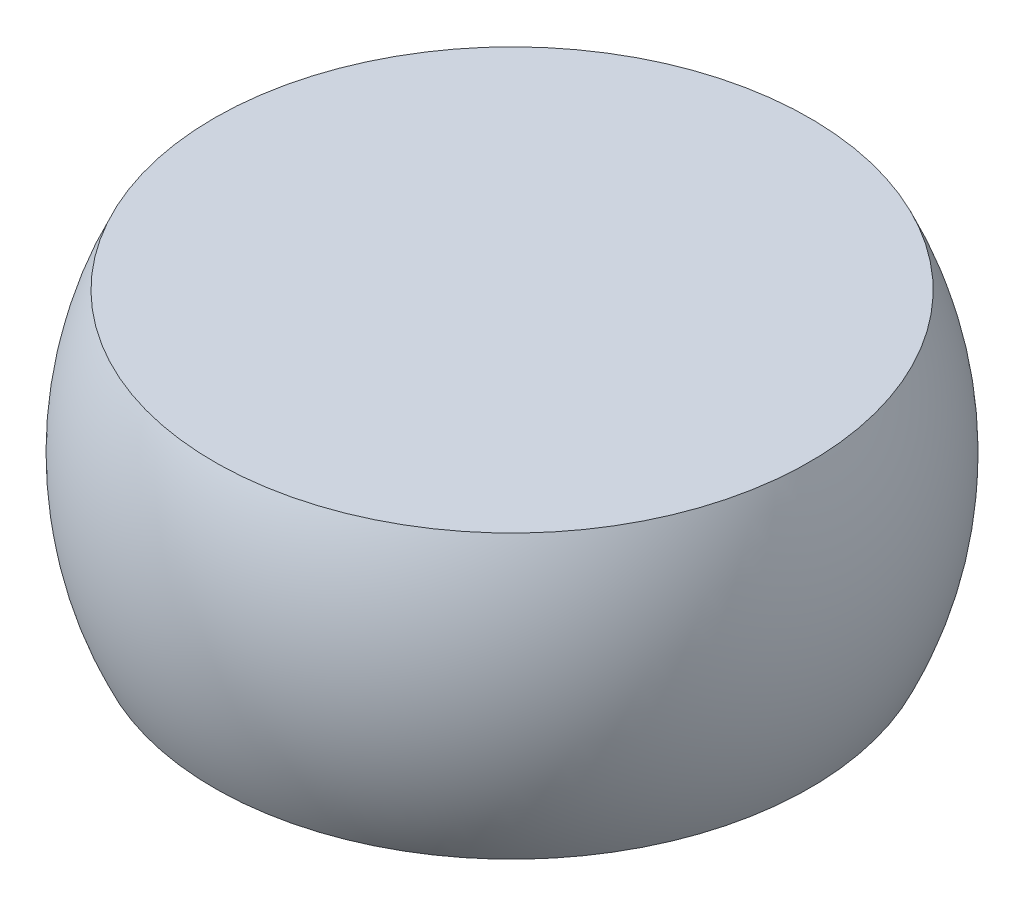
ISO-10303-21;
HEADER;
FILE_DESCRIPTION(('STEP AP214'),'2;1');
FILE_NAME('part.step','',(''),(''),'','','');
FILE_SCHEMA(('AUTOMOTIVE_DESIGN { 1 0 10303 214 1 1 1 1 }'));
ENDSEC;
DATA;
#1=APPLICATION_CONTEXT('core data for automotive mechanical design processes');
#2=APPLICATION_PROTOCOL_DEFINITION('international standard','automotive_design',2000,#1);
#3=PRODUCT_CONTEXT('',#1,'mechanical');
#4=PRODUCT('Part','Part','',(#3));
#5=PRODUCT_RELATED_PRODUCT_CATEGORY('part','',(#4));
#6=PRODUCT_DEFINITION_FORMATION('','',#4);
#7=PRODUCT_DEFINITION_CONTEXT('part definition',#1,'design');
#8=PRODUCT_DEFINITION('design','',#6,#7);
#9=PRODUCT_DEFINITION_SHAPE('','',#8);
#10=(LENGTH_UNIT() NAMED_UNIT(*) SI_UNIT(.MILLI.,.METRE.));
#11=(NAMED_UNIT(*) PLANE_ANGLE_UNIT() SI_UNIT($,.RADIAN.));
#12=(NAMED_UNIT(*) SI_UNIT($,.STERADIAN.) SOLID_ANGLE_UNIT());
#13=UNCERTAINTY_MEASURE_WITH_UNIT(LENGTH_MEASURE(1.E-05),#10,'distance_accuracy_value','');
#14=(GEOMETRIC_REPRESENTATION_CONTEXT(3) GLOBAL_UNCERTAINTY_ASSIGNED_CONTEXT((#13)) GLOBAL_UNIT_ASSIGNED_CONTEXT((#10,
#11,#12)) REPRESENTATION_CONTEXT('',''));
#15=CARTESIAN_POINT('',(0.,0.,0.));
#16=DIRECTION('',(0.,0.,1.));
#17=DIRECTION('',(1.,0.,0.));
#18=AXIS2_PLACEMENT_3D('',#15,#16,#17);
#19=CARTESIAN_POINT('',(0.,0.15,0.));
#20=DIRECTION('',(0.,-1.,0.));
#21=DIRECTION('',(1.,0.,0.));
#22=AXIS2_PLACEMENT_3D('',#19,#20,#21);
#23=PLANE('',#22);
#24=CARTESIAN_POINT('',(0.,0.15,0.));
#25=DIRECTION('',(0.,1.,0.));
#26=DIRECTION('',(-1.,0.,0.));
#27=AXIS2_PLACEMENT_3D('',#24,#25,#26);
#28=CIRCLE('',#27,0.316227766016838);
#29=CARTESIAN_POINT('',(-0.316227766016838,0.15,0.));
#30=VERTEX_POINT('',#29);
#31=EDGE_CURVE('E36',#30,#30,#28,.T.);
#32=ORIENTED_EDGE('',*,*,#31,.T.);
#33=EDGE_LOOP('',(#32));
#34=FACE_BOUND('',#33,.T.);
#35=ADVANCED_FACE('F30',(#34),#23,.F.);
#36=CARTESIAN_POINT('',(0.,-0.15,0.));
#37=DIRECTION('',(0.,1.,0.));
#38=DIRECTION('',(-1.,0.,0.));
#39=AXIS2_PLACEMENT_3D('',#36,#37,#38);
#40=PLANE('',#39);
#41=CARTESIAN_POINT('',(0.,-0.15,0.));
#42=DIRECTION('',(0.,1.,0.));
#43=DIRECTION('',(-1.,0.,0.));
#44=AXIS2_PLACEMENT_3D('',#41,#42,#43);
#45=CIRCLE('',#44,0.316227766016838);
#46=CARTESIAN_POINT('',(-0.316227766016838,-0.15,0.));
#47=VERTEX_POINT('',#46);
#48=EDGE_CURVE('E10',#47,#47,#45,.T.);
#49=ORIENTED_EDGE('',*,*,#48,.F.);
#50=EDGE_LOOP('',(#49));
#51=FACE_BOUND('',#50,.T.);
#52=ADVANCED_FACE('F45',(#51),#40,.F.);
#53=CARTESIAN_POINT('',(0.,0.,0.));
#54=DIRECTION('',(0.,1.,0.));
#55=DIRECTION('',(1.,0.,0.));
#56=AXIS2_PLACEMENT_3D('',#53,#54,#55);
#57=SPHERICAL_SURFACE('',#56,0.35);
#58=ORIENTED_EDGE('',*,*,#31,.F.);
#59=EDGE_LOOP('',(#58));
#60=FACE_BOUND('',#59,.T.);
#61=ORIENTED_EDGE('',*,*,#48,.T.);
#62=EDGE_LOOP('',(#61));
#63=FACE_BOUND('',#62,.T.);
#64=ADVANCED_FACE('F43',(#60,#63),#57,.T.);
#65=CLOSED_SHELL('',(#35,#52,#64));
#66=MANIFOLD_SOLID_BREP('B2',#65);
#67=ADVANCED_BREP_SHAPE_REPRESENTATION('',(#18,#66),#14);
#68=SHAPE_DEFINITION_REPRESENTATION(#9,#67);
ENDSEC;
END-ISO-10303-21;
